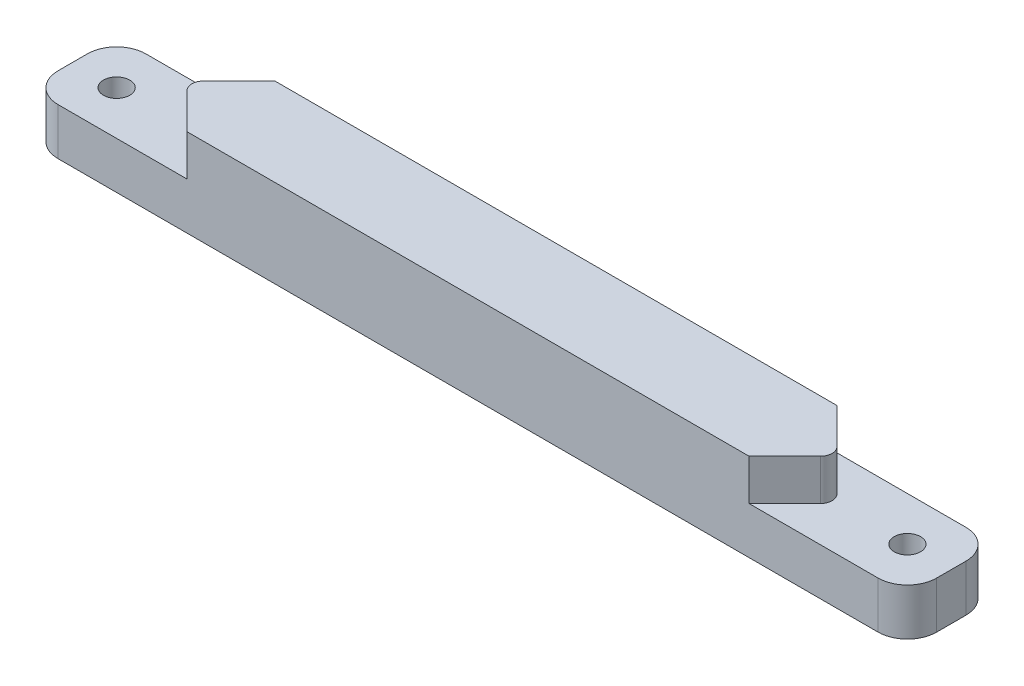
ISO-10303-21;
HEADER;
FILE_DESCRIPTION(('STEP AP214'),'2;1');
FILE_NAME('part.step','',(''),(''),'','','');
FILE_SCHEMA(('AUTOMOTIVE_DESIGN { 1 0 10303 214 1 1 1 1 }'));
ENDSEC;
DATA;
#1=APPLICATION_CONTEXT('core data for automotive mechanical design processes');
#2=APPLICATION_PROTOCOL_DEFINITION('international standard','automotive_design',2000,#1);
#3=PRODUCT_CONTEXT('',#1,'mechanical');
#4=PRODUCT('Part','Part','',(#3));
#5=PRODUCT_RELATED_PRODUCT_CATEGORY('part','',(#4));
#6=PRODUCT_DEFINITION_FORMATION('','',#4);
#7=PRODUCT_DEFINITION_CONTEXT('part definition',#1,'design');
#8=PRODUCT_DEFINITION('design','',#6,#7);
#9=PRODUCT_DEFINITION_SHAPE('','',#8);
#10=(LENGTH_UNIT() NAMED_UNIT(*) SI_UNIT(.MILLI.,.METRE.));
#11=(NAMED_UNIT(*) PLANE_ANGLE_UNIT() SI_UNIT($,.RADIAN.));
#12=(NAMED_UNIT(*) SI_UNIT($,.STERADIAN.) SOLID_ANGLE_UNIT());
#13=UNCERTAINTY_MEASURE_WITH_UNIT(LENGTH_MEASURE(1.E-05),#10,'distance_accuracy_value','');
#14=(GEOMETRIC_REPRESENTATION_CONTEXT(3) GLOBAL_UNCERTAINTY_ASSIGNED_CONTEXT((#13)) GLOBAL_UNIT_ASSIGNED_CONTEXT((#10,
#11,#12)) REPRESENTATION_CONTEXT('',''));
#15=CARTESIAN_POINT('',(0.,0.,0.));
#16=DIRECTION('',(0.,0.,1.));
#17=DIRECTION('',(1.,0.,0.));
#18=AXIS2_PLACEMENT_3D('',#15,#16,#17);
#19=CARTESIAN_POINT('',(0.,15.,0.));
#20=DIRECTION('',(0.,0.,-1.));
#21=DIRECTION('',(-1.,0.,0.));
#22=AXIS2_PLACEMENT_3D('',#19,#20,#21);
#23=PLANE('',#22);
#24=DIRECTION('',(-1.,0.,0.));
#25=VECTOR('',#24,1.);
#26=CARTESIAN_POINT('',(150.,8.,0.));
#27=LINE('',#26,#25);
#28=CARTESIAN_POINT('',(145.,8.,0.));
#29=VERTEX_POINT('',#28);
#30=CARTESIAN_POINT('',(122.979184719829,8.,0.));
#31=VERTEX_POINT('',#30);
#32=EDGE_CURVE('E172',#29,#31,#27,.T.);
#33=ORIENTED_EDGE('',*,*,#32,.T.);
#34=DIRECTION('',(0.,1.,0.));
#35=VECTOR('',#34,1.);
#36=CARTESIAN_POINT('',(122.979184719829,-10.613392206679,0.));
#37=LINE('',#36,#35);
#38=CARTESIAN_POINT('',(122.979184719829,15.,0.));
#39=VERTEX_POINT('',#38);
#40=EDGE_CURVE('E160',#31,#39,#37,.T.);
#41=ORIENTED_EDGE('',*,*,#40,.T.);
#42=DIRECTION('',(1.,0.,0.));
#43=VECTOR('',#42,1.);
#44=CARTESIAN_POINT('',(0.,15.,0.));
#45=LINE('',#44,#43);
#46=CARTESIAN_POINT('',(27.0208152801714,15.,0.));
#47=VERTEX_POINT('',#46);
#48=EDGE_CURVE('E170',#47,#39,#45,.T.);
#49=ORIENTED_EDGE('',*,*,#48,.F.);
#50=DIRECTION('',(0.,1.,0.));
#51=VECTOR('',#50,1.);
#52=CARTESIAN_POINT('',(27.0208152801714,-10.613392206679,0.));
#53=LINE('',#52,#51);
#54=CARTESIAN_POINT('',(27.0208152801714,8.,0.));
#55=VERTEX_POINT('',#54);
#56=EDGE_CURVE('E296',#55,#47,#53,.T.);
#57=ORIENTED_EDGE('',*,*,#56,.F.);
#58=DIRECTION('',(1.,0.,0.));
#59=VECTOR('',#58,1.);
#60=CARTESIAN_POINT('',(0.,8.,0.));
#61=LINE('',#60,#59);
#62=CARTESIAN_POINT('',(5.,8.,0.));
#63=VERTEX_POINT('',#62);
#64=EDGE_CURVE('E345',#63,#55,#61,.T.);
#65=ORIENTED_EDGE('',*,*,#64,.F.);
#66=DIRECTION('',(0.,-1.,0.));
#67=VECTOR('',#66,1.);
#68=CARTESIAN_POINT('',(5.,15.,0.));
#69=LINE('',#68,#67);
#70=CARTESIAN_POINT('',(5.,0.,0.));
#71=VERTEX_POINT('',#70);
#72=EDGE_CURVE('E238',#63,#71,#69,.T.);
#73=ORIENTED_EDGE('',*,*,#72,.T.);
#74=DIRECTION('',(1.,0.,0.));
#75=VECTOR('',#74,1.);
#76=CARTESIAN_POINT('',(0.,0.,0.));
#77=LINE('',#76,#75);
#78=CARTESIAN_POINT('',(145.,0.,0.));
#79=VERTEX_POINT('',#78);
#80=EDGE_CURVE('E200',#71,#79,#77,.T.);
#81=ORIENTED_EDGE('',*,*,#80,.T.);
#82=DIRECTION('',(0.,-1.,0.));
#83=VECTOR('',#82,1.);
#84=CARTESIAN_POINT('',(145.,15.,0.));
#85=LINE('',#84,#83);
#86=EDGE_CURVE('E242',#79,#29,#85,.F.);
#87=ORIENTED_EDGE('',*,*,#86,.T.);
#88=EDGE_LOOP('',(#33,#41,#49,#57,#65,#73,#81,#87));
#89=FACE_BOUND('',#88,.T.);
#90=ADVANCED_FACE('F43',(#89),#23,.F.);
#91=CARTESIAN_POINT('',(0.,15.,-15.));
#92=DIRECTION('',(0.,0.,1.));
#93=DIRECTION('',(1.,0.,0.));
#94=AXIS2_PLACEMENT_3D('',#91,#92,#93);
#95=PLANE('',#94);
#96=DIRECTION('',(-1.,0.,0.));
#97=VECTOR('',#96,1.);
#98=CARTESIAN_POINT('',(0.,15.,-15.));
#99=LINE('',#98,#97);
#100=CARTESIAN_POINT('',(122.979184719829,15.,-15.));
#101=VERTEX_POINT('',#100);
#102=CARTESIAN_POINT('',(27.0208152801714,15.,-15.));
#103=VERTEX_POINT('',#102);
#104=EDGE_CURVE('E182',#101,#103,#99,.T.);
#105=ORIENTED_EDGE('',*,*,#104,.F.);
#106=DIRECTION('',(0.,1.,0.));
#107=VECTOR('',#106,1.);
#108=CARTESIAN_POINT('',(122.979184719829,-10.613392206679,-15.));
#109=LINE('',#108,#107);
#110=CARTESIAN_POINT('',(122.979184719829,8.,-15.));
#111=VERTEX_POINT('',#110);
#112=EDGE_CURVE('E175',#111,#101,#109,.T.);
#113=ORIENTED_EDGE('',*,*,#112,.F.);
#114=DIRECTION('',(1.,0.,0.));
#115=VECTOR('',#114,1.);
#116=CARTESIAN_POINT('',(150.,8.,-15.));
#117=LINE('',#116,#115);
#118=CARTESIAN_POINT('',(145.,8.,-15.));
#119=VERTEX_POINT('',#118);
#120=EDGE_CURVE('E328',#111,#119,#117,.T.);
#121=ORIENTED_EDGE('',*,*,#120,.T.);
#122=DIRECTION('',(0.,-1.,0.));
#123=VECTOR('',#122,1.);
#124=CARTESIAN_POINT('',(145.,15.,-15.));
#125=LINE('',#124,#123);
#126=CARTESIAN_POINT('',(145.,0.,-15.));
#127=VERTEX_POINT('',#126);
#128=EDGE_CURVE('E209',#119,#127,#125,.T.);
#129=ORIENTED_EDGE('',*,*,#128,.T.);
#130=DIRECTION('',(-1.,0.,0.));
#131=VECTOR('',#130,1.);
#132=CARTESIAN_POINT('',(0.,0.,-15.));
#133=LINE('',#132,#131);
#134=CARTESIAN_POINT('',(5.,0.,-15.));
#135=VERTEX_POINT('',#134);
#136=EDGE_CURVE('E183',#127,#135,#133,.T.);
#137=ORIENTED_EDGE('',*,*,#136,.T.);
#138=DIRECTION('',(0.,-1.,0.));
#139=VECTOR('',#138,1.);
#140=CARTESIAN_POINT('',(5.,15.,-15.));
#141=LINE('',#140,#139);
#142=CARTESIAN_POINT('',(5.,8.,-15.));
#143=VERTEX_POINT('',#142);
#144=EDGE_CURVE('E187',#135,#143,#141,.F.);
#145=ORIENTED_EDGE('',*,*,#144,.T.);
#146=DIRECTION('',(-1.,0.,0.));
#147=VECTOR('',#146,1.);
#148=CARTESIAN_POINT('',(0.,8.,-15.));
#149=LINE('',#148,#147);
#150=CARTESIAN_POINT('',(27.0208152801714,7.99999999999999,-15.));
#151=VERTEX_POINT('',#150);
#152=EDGE_CURVE('E193',#151,#143,#149,.T.);
#153=ORIENTED_EDGE('',*,*,#152,.F.);
#154=DIRECTION('',(0.,1.,0.));
#155=VECTOR('',#154,1.);
#156=CARTESIAN_POINT('',(27.0208152801714,-10.613392206679,-15.));
#157=LINE('',#156,#155);
#158=EDGE_CURVE('E294',#151,#103,#157,.T.);
#159=ORIENTED_EDGE('',*,*,#158,.T.);
#160=EDGE_LOOP('',(#105,#113,#121,#129,#137,#145,#153,#159));
#161=FACE_BOUND('',#160,.T.);
#162=ADVANCED_FACE('F387',(#161),#95,.F.);
#163=CARTESIAN_POINT('',(0.,15.,0.));
#164=DIRECTION('',(0.,-1.,0.));
#165=DIRECTION('',(0.,0.,-1.));
#166=AXIS2_PLACEMENT_3D('',#163,#164,#165);
#167=PLANE('',#166);
#168=DIRECTION('',(-0.707106781186549,0.,0.707106781186546));
#169=VECTOR('',#168,1.);
#170=CARTESIAN_POINT('',(136.489592359914,15.,-13.5104076400857));
#171=LINE('',#170,#169);
#172=CARTESIAN_POINT('',(129.064971157456,15.,-6.08578643762687));
#173=VERTEX_POINT('',#172);
#174=EDGE_CURVE('E156',#173,#39,#171,.T.);
#175=ORIENTED_EDGE('',*,*,#174,.F.);
#176=CARTESIAN_POINT('',(127.650757595082,15.,-7.49999999999997));
#177=DIRECTION('',(0.,-1.,0.));
#178=DIRECTION('',(0.,0.,-1.));
#179=AXIS2_PLACEMENT_3D('',#176,#177,#178);
#180=CIRCLE('',#179,2.);
#181=CARTESIAN_POINT('',(129.064971157456,15.,-8.91421356237305));
#182=VERTEX_POINT('',#181);
#183=EDGE_CURVE('E66',#173,#182,#180,.F.);
#184=ORIENTED_EDGE('',*,*,#183,.T.);
#185=DIRECTION('',(0.707106781186546,0.,0.707106781186549));
#186=VECTOR('',#185,1.);
#187=CARTESIAN_POINT('',(143.989592359914,15.,6.01040764008574));
#188=LINE('',#187,#186);
#189=EDGE_CURVE('E165',#101,#182,#188,.T.);
#190=ORIENTED_EDGE('',*,*,#189,.F.);
#191=ORIENTED_EDGE('',*,*,#104,.T.);
#192=DIRECTION('',(-0.707106781186546,0.,0.707106781186549));
#193=VECTOR('',#192,1.);
#194=CARTESIAN_POINT('',(6.01040764008576,15.,6.01040764008574));
#195=LINE('',#194,#193);
#196=CARTESIAN_POINT('',(20.9350288425445,15.,-8.91421356237306));
#197=VERTEX_POINT('',#196);
#198=EDGE_CURVE('E299',#103,#197,#195,.T.);
#199=ORIENTED_EDGE('',*,*,#198,.T.);
#200=CARTESIAN_POINT('',(22.3492424049176,15.,-7.49999999999996));
#201=DIRECTION('',(0.,-1.,0.));
#202=DIRECTION('',(0.,0.,-1.));
#203=AXIS2_PLACEMENT_3D('',#200,#201,#202);
#204=CIRCLE('',#203,2.);
#205=CARTESIAN_POINT('',(20.9350288425445,15.,-6.08578643762686));
#206=VERTEX_POINT('',#205);
#207=EDGE_CURVE('E262',#197,#206,#204,.F.);
#208=ORIENTED_EDGE('',*,*,#207,.T.);
#209=DIRECTION('',(0.707106781186549,0.,0.707106781186546));
#210=VECTOR('',#209,1.);
#211=CARTESIAN_POINT('',(13.5104076400856,15.,-13.5104076400857));
#212=LINE('',#211,#210);
#213=EDGE_CURVE('E179',#206,#47,#212,.T.);
#214=ORIENTED_EDGE('',*,*,#213,.T.);
#215=ORIENTED_EDGE('',*,*,#48,.T.);
#216=EDGE_LOOP('',(#175,#184,#190,#191,#199,#208,#214,#215));
#217=FACE_BOUND('',#216,.T.);
#218=ADVANCED_FACE('F177',(#217),#167,.F.);
#219=CARTESIAN_POINT('',(150.,15.,0.));
#220=DIRECTION('',(-1.,0.,0.));
#221=DIRECTION('',(0.,0.,1.));
#222=AXIS2_PLACEMENT_3D('',#219,#220,#221);
#223=PLANE('',#222);
#224=DIRECTION('',(0.,0.,-1.));
#225=VECTOR('',#224,1.);
#226=CARTESIAN_POINT('',(150.,0.,0.));
#227=LINE('',#226,#225);
#228=CARTESIAN_POINT('',(150.,0.,-5.));
#229=VERTEX_POINT('',#228);
#230=CARTESIAN_POINT('',(150.,0.,-10.));
#231=VERTEX_POINT('',#230);
#232=EDGE_CURVE('E190',#229,#231,#227,.T.);
#233=ORIENTED_EDGE('',*,*,#232,.T.);
#234=DIRECTION('',(0.,-1.,0.));
#235=VECTOR('',#234,1.);
#236=CARTESIAN_POINT('',(150.,15.,-10.));
#237=LINE('',#236,#235);
#238=CARTESIAN_POINT('',(150.,8.,-10.));
#239=VERTEX_POINT('',#238);
#240=EDGE_CURVE('E229',#231,#239,#237,.F.);
#241=ORIENTED_EDGE('',*,*,#240,.T.);
#242=DIRECTION('',(0.,0.,1.));
#243=VECTOR('',#242,1.);
#244=CARTESIAN_POINT('',(150.,8.,-15.));
#245=LINE('',#244,#243);
#246=CARTESIAN_POINT('',(150.,8.,-5.));
#247=VERTEX_POINT('',#246);
#248=EDGE_CURVE('E324',#239,#247,#245,.T.);
#249=ORIENTED_EDGE('',*,*,#248,.T.);
#250=DIRECTION('',(0.,-1.,0.));
#251=VECTOR('',#250,1.);
#252=CARTESIAN_POINT('',(150.,15.,-5.));
#253=LINE('',#252,#251);
#254=EDGE_CURVE('E225',#247,#229,#253,.T.);
#255=ORIENTED_EDGE('',*,*,#254,.T.);
#256=EDGE_LOOP('',(#233,#241,#249,#255));
#257=FACE_BOUND('',#256,.T.);
#258=ADVANCED_FACE('F378',(#257),#223,.F.);
#259=CARTESIAN_POINT('',(0.,15.,0.));
#260=DIRECTION('',(1.,0.,0.));
#261=DIRECTION('',(0.,0.,-1.));
#262=AXIS2_PLACEMENT_3D('',#259,#260,#261);
#263=PLANE('',#262);
#264=DIRECTION('',(0.,0.,1.));
#265=VECTOR('',#264,1.);
#266=CARTESIAN_POINT('',(0.,8.,-15.));
#267=LINE('',#266,#265);
#268=CARTESIAN_POINT('',(0.,8.,-10.));
#269=VERTEX_POINT('',#268);
#270=CARTESIAN_POINT('',(0.,8.,-5.));
#271=VERTEX_POINT('',#270);
#272=EDGE_CURVE('E342',#269,#271,#267,.T.);
#273=ORIENTED_EDGE('',*,*,#272,.F.);
#274=DIRECTION('',(0.,-1.,0.));
#275=VECTOR('',#274,1.);
#276=CARTESIAN_POINT('',(0.,15.,-10.));
#277=LINE('',#276,#275);
#278=CARTESIAN_POINT('',(0.,0.,-10.));
#279=VERTEX_POINT('',#278);
#280=EDGE_CURVE('E248',#269,#279,#277,.T.);
#281=ORIENTED_EDGE('',*,*,#280,.T.);
#282=DIRECTION('',(0.,0.,1.));
#283=VECTOR('',#282,1.);
#284=CARTESIAN_POINT('',(0.,0.,0.));
#285=LINE('',#284,#283);
#286=CARTESIAN_POINT('',(0.,0.,-5.));
#287=VERTEX_POINT('',#286);
#288=EDGE_CURVE('E196',#279,#287,#285,.T.);
#289=ORIENTED_EDGE('',*,*,#288,.T.);
#290=DIRECTION('',(0.,-1.,0.));
#291=VECTOR('',#290,1.);
#292=CARTESIAN_POINT('',(0.,15.,-5.));
#293=LINE('',#292,#291);
#294=EDGE_CURVE('E245',#287,#271,#293,.F.);
#295=ORIENTED_EDGE('',*,*,#294,.T.);
#296=EDGE_LOOP('',(#273,#281,#289,#295));
#297=FACE_BOUND('',#296,.T.);
#298=ADVANCED_FACE('F358',(#297),#263,.F.);
#299=CARTESIAN_POINT('',(0.,0.,0.));
#300=DIRECTION('',(0.,-1.,0.));
#301=DIRECTION('',(0.,0.,-1.));
#302=AXIS2_PLACEMENT_3D('',#299,#300,#301);
#303=PLANE('',#302);
#304=CARTESIAN_POINT('',(142.5,0.,-7.5));
#305=DIRECTION('',(0.,-1.,0.));
#306=DIRECTION('',(0.,0.,-1.));
#307=AXIS2_PLACEMENT_3D('',#304,#305,#306);
#308=CIRCLE('',#307,2.25);
#309=CARTESIAN_POINT('',(142.5,0.,-9.75));
#310=VERTEX_POINT('',#309);
#311=EDGE_CURVE('E320',#310,#310,#308,.T.);
#312=ORIENTED_EDGE('',*,*,#311,.F.);
#313=EDGE_LOOP('',(#312));
#314=FACE_BOUND('',#313,.T.);
#315=CARTESIAN_POINT('',(7.5,0.,-7.5));
#316=DIRECTION('',(0.,-1.,0.));
#317=DIRECTION('',(0.,0.,-1.));
#318=AXIS2_PLACEMENT_3D('',#315,#316,#317);
#319=CIRCLE('',#318,2.25);
#320=CARTESIAN_POINT('',(7.5,0.,-9.75));
#321=VERTEX_POINT('',#320);
#322=EDGE_CURVE('E338',#321,#321,#319,.F.);
#323=ORIENTED_EDGE('',*,*,#322,.T.);
#324=EDGE_LOOP('',(#323));
#325=FACE_BOUND('',#324,.T.);
#326=ORIENTED_EDGE('',*,*,#136,.F.);
#327=CARTESIAN_POINT('',(145.,0.,-10.));
#328=DIRECTION('',(0.,-1.,0.));
#329=DIRECTION('',(0.,0.,-1.));
#330=AXIS2_PLACEMENT_3D('',#327,#328,#329);
#331=CIRCLE('',#330,5.);
#332=EDGE_CURVE('E222',#127,#231,#331,.T.);
#333=ORIENTED_EDGE('',*,*,#332,.T.);
#334=ORIENTED_EDGE('',*,*,#232,.F.);
#335=CARTESIAN_POINT('',(145.,0.,-5.));
#336=DIRECTION('',(0.,-1.,0.));
#337=DIRECTION('',(0.,0.,-1.));
#338=AXIS2_PLACEMENT_3D('',#335,#336,#337);
#339=CIRCLE('',#338,5.);
#340=EDGE_CURVE('E219',#229,#79,#339,.T.);
#341=ORIENTED_EDGE('',*,*,#340,.T.);
#342=ORIENTED_EDGE('',*,*,#80,.F.);
#343=CARTESIAN_POINT('',(5.,0.,-5.));
#344=DIRECTION('',(0.,-1.,0.));
#345=DIRECTION('',(0.,0.,-1.));
#346=AXIS2_PLACEMENT_3D('',#343,#344,#345);
#347=CIRCLE('',#346,5.);
#348=EDGE_CURVE('E213',#71,#287,#347,.T.);
#349=ORIENTED_EDGE('',*,*,#348,.T.);
#350=ORIENTED_EDGE('',*,*,#288,.F.);
#351=CARTESIAN_POINT('',(5.,0.,-10.));
#352=DIRECTION('',(0.,-1.,0.));
#353=DIRECTION('',(0.,0.,-1.));
#354=AXIS2_PLACEMENT_3D('',#351,#352,#353);
#355=CIRCLE('',#354,5.);
#356=EDGE_CURVE('E216',#279,#135,#355,.T.);
#357=ORIENTED_EDGE('',*,*,#356,.T.);
#358=EDGE_LOOP('',(#326,#333,#334,#341,#342,#349,#350,#357));
#359=FACE_BOUND('',#358,.T.);
#360=ADVANCED_FACE('F362',(#314,#325,#359),#303,.T.);
#361=CARTESIAN_POINT('',(0.,8.,0.));
#362=DIRECTION('',(0.,1.,0.));
#363=DIRECTION('',(0.,0.,1.));
#364=AXIS2_PLACEMENT_3D('',#361,#362,#363);
#365=PLANE('',#364);
#366=CARTESIAN_POINT('',(7.5,8.,-7.5));
#367=DIRECTION('',(0.,1.,0.));
#368=DIRECTION('',(0.,0.,1.));
#369=AXIS2_PLACEMENT_3D('',#366,#367,#368);
#370=CIRCLE('',#369,2.25);
#371=CARTESIAN_POINT('',(7.5,8.,-5.25));
#372=VERTEX_POINT('',#371);
#373=EDGE_CURVE('E334',#372,#372,#370,.T.);
#374=ORIENTED_EDGE('',*,*,#373,.F.);
#375=EDGE_LOOP('',(#374));
#376=FACE_BOUND('',#375,.T.);
#377=ORIENTED_EDGE('',*,*,#152,.T.);
#378=CARTESIAN_POINT('',(5.,8.,-10.));
#379=DIRECTION('',(0.,1.,0.));
#380=DIRECTION('',(0.,0.,1.));
#381=AXIS2_PLACEMENT_3D('',#378,#379,#380);
#382=CIRCLE('',#381,5.);
#383=EDGE_CURVE('E255',#143,#269,#382,.T.);
#384=ORIENTED_EDGE('',*,*,#383,.T.);
#385=ORIENTED_EDGE('',*,*,#272,.T.);
#386=CARTESIAN_POINT('',(5.,8.,-5.));
#387=DIRECTION('',(0.,1.,0.));
#388=DIRECTION('',(0.,0.,1.));
#389=AXIS2_PLACEMENT_3D('',#386,#387,#388);
#390=CIRCLE('',#389,5.);
#391=EDGE_CURVE('E252',#271,#63,#390,.T.);
#392=ORIENTED_EDGE('',*,*,#391,.T.);
#393=ORIENTED_EDGE('',*,*,#64,.T.);
#394=DIRECTION('',(-0.707106781186549,0.,-0.707106781186546));
#395=VECTOR('',#394,1.);
#396=CARTESIAN_POINT('',(13.5104076400856,8.,-13.5104076400857));
#397=LINE('',#396,#395);
#398=CARTESIAN_POINT('',(20.9350288425445,8.,-6.08578643762687));
#399=VERTEX_POINT('',#398);
#400=EDGE_CURVE('E284',#55,#399,#397,.T.);
#401=ORIENTED_EDGE('',*,*,#400,.T.);
#402=CARTESIAN_POINT('',(22.3492424049176,8.,-7.49999999999996));
#403=DIRECTION('',(0.,1.,0.));
#404=DIRECTION('',(0.,0.,1.));
#405=AXIS2_PLACEMENT_3D('',#402,#403,#404);
#406=CIRCLE('',#405,2.);
#407=CARTESIAN_POINT('',(20.9350288425445,8.,-8.91421356237305));
#408=VERTEX_POINT('',#407);
#409=EDGE_CURVE('E268',#399,#408,#406,.F.);
#410=ORIENTED_EDGE('',*,*,#409,.T.);
#411=DIRECTION('',(0.707106781186546,0.,-0.707106781186549));
#412=VECTOR('',#411,1.);
#413=CARTESIAN_POINT('',(6.01040764008576,8.,6.01040764008574));
#414=LINE('',#413,#412);
#415=EDGE_CURVE('E281',#408,#151,#414,.T.);
#416=ORIENTED_EDGE('',*,*,#415,.T.);
#417=EDGE_LOOP('',(#377,#384,#385,#392,#393,#401,#410,#416));
#418=FACE_BOUND('',#417,.T.);
#419=ADVANCED_FACE('F280',(#376,#418),#365,.T.);
#420=CARTESIAN_POINT('',(7.5,-6.36396103067893,-7.5));
#421=DIRECTION('',(0.,1.,0.));
#422=DIRECTION('',(0.,0.,1.));
#423=AXIS2_PLACEMENT_3D('',#420,#421,#422);
#424=CYLINDRICAL_SURFACE('',#423,2.25);
#425=ORIENTED_EDGE('',*,*,#373,.T.);
#426=EDGE_LOOP('',(#425));
#427=FACE_BOUND('',#426,.T.);
#428=ORIENTED_EDGE('',*,*,#322,.F.);
#429=EDGE_LOOP('',(#428));
#430=FACE_BOUND('',#429,.T.);
#431=ADVANCED_FACE('F437',(#427,#430),#424,.F.);
#432=CARTESIAN_POINT('',(150.,8.,0.));
#433=DIRECTION('',(0.,1.,0.));
#434=DIRECTION('',(0.,0.,1.));
#435=AXIS2_PLACEMENT_3D('',#432,#433,#434);
#436=PLANE('',#435);
#437=CARTESIAN_POINT('',(142.5,8.,-7.5));
#438=DIRECTION('',(0.,-1.,0.));
#439=DIRECTION('',(0.,0.,1.));
#440=AXIS2_PLACEMENT_3D('',#437,#438,#439);
#441=CIRCLE('',#440,2.25);
#442=CARTESIAN_POINT('',(142.5,8.,-5.25));
#443=VERTEX_POINT('',#442);
#444=EDGE_CURVE('E316',#443,#443,#441,.T.);
#445=ORIENTED_EDGE('',*,*,#444,.T.);
#446=EDGE_LOOP('',(#445));
#447=FACE_BOUND('',#446,.T.);
#448=ORIENTED_EDGE('',*,*,#248,.F.);
#449=CARTESIAN_POINT('',(145.,8.,-10.));
#450=DIRECTION('',(0.,1.,0.));
#451=DIRECTION('',(0.,0.,1.));
#452=AXIS2_PLACEMENT_3D('',#449,#450,#451);
#453=CIRCLE('',#452,5.);
#454=EDGE_CURVE('E235',#239,#119,#453,.T.);
#455=ORIENTED_EDGE('',*,*,#454,.T.);
#456=ORIENTED_EDGE('',*,*,#120,.F.);
#457=DIRECTION('',(-0.707106781186546,0.,-0.707106781186549));
#458=VECTOR('',#457,1.);
#459=CARTESIAN_POINT('',(143.989592359914,8.,6.01040764008574));
#460=LINE('',#459,#458);
#461=CARTESIAN_POINT('',(129.064971157456,8.,-8.91421356237305));
#462=VERTEX_POINT('',#461);
#463=EDGE_CURVE('E308',#462,#111,#460,.T.);
#464=ORIENTED_EDGE('',*,*,#463,.F.);
#465=CARTESIAN_POINT('',(127.650757595082,8.,-7.49999999999997));
#466=DIRECTION('',(0.,1.,0.));
#467=DIRECTION('',(0.,0.,1.));
#468=AXIS2_PLACEMENT_3D('',#465,#466,#467);
#469=CIRCLE('',#468,2.);
#470=CARTESIAN_POINT('',(129.064971157456,8.,-6.08578643762687));
#471=VERTEX_POINT('',#470);
#472=EDGE_CURVE('E12',#462,#471,#469,.F.);
#473=ORIENTED_EDGE('',*,*,#472,.T.);
#474=DIRECTION('',(0.707106781186549,0.,-0.707106781186546));
#475=VECTOR('',#474,1.);
#476=CARTESIAN_POINT('',(136.489592359914,8.,-13.5104076400857));
#477=LINE('',#476,#475);
#478=EDGE_CURVE('E303',#31,#471,#477,.T.);
#479=ORIENTED_EDGE('',*,*,#478,.F.);
#480=ORIENTED_EDGE('',*,*,#32,.F.);
#481=CARTESIAN_POINT('',(145.,8.,-5.));
#482=DIRECTION('',(0.,1.,0.));
#483=DIRECTION('',(0.,0.,1.));
#484=AXIS2_PLACEMENT_3D('',#481,#482,#483);
#485=CIRCLE('',#484,5.);
#486=EDGE_CURVE('E232',#29,#247,#485,.T.);
#487=ORIENTED_EDGE('',*,*,#486,.T.);
#488=EDGE_LOOP('',(#448,#455,#456,#464,#473,#479,#480,#487));
#489=FACE_BOUND('',#488,.T.);
#490=ADVANCED_FACE('F375',(#447,#489),#436,.T.);
#491=CARTESIAN_POINT('',(142.5,-6.36396103067893,-7.5));
#492=DIRECTION('',(0.,1.,0.));
#493=DIRECTION('',(0.,0.,1.));
#494=AXIS2_PLACEMENT_3D('',#491,#492,#493);
#495=CYLINDRICAL_SURFACE('',#494,2.25);
#496=ORIENTED_EDGE('',*,*,#444,.F.);
#497=EDGE_LOOP('',(#496));
#498=FACE_BOUND('',#497,.T.);
#499=ORIENTED_EDGE('',*,*,#311,.T.);
#500=EDGE_LOOP('',(#499));
#501=FACE_BOUND('',#500,.T.);
#502=ADVANCED_FACE('F414',(#498,#501),#495,.F.);
#503=CARTESIAN_POINT('',(145.,15.,-10.));
#504=DIRECTION('',(0.,-1.,0.));
#505=DIRECTION('',(0.,0.,-1.));
#506=AXIS2_PLACEMENT_3D('',#503,#504,#505);
#507=CYLINDRICAL_SURFACE('',#506,5.);
#508=ORIENTED_EDGE('',*,*,#454,.F.);
#509=ORIENTED_EDGE('',*,*,#240,.F.);
#510=ORIENTED_EDGE('',*,*,#332,.F.);
#511=ORIENTED_EDGE('',*,*,#128,.F.);
#512=EDGE_LOOP('',(#508,#509,#510,#511));
#513=FACE_BOUND('',#512,.T.);
#514=ADVANCED_FACE('F382',(#513),#507,.T.);
#515=CARTESIAN_POINT('',(145.,15.,-5.));
#516=DIRECTION('',(0.,-1.,0.));
#517=DIRECTION('',(0.,0.,-1.));
#518=AXIS2_PLACEMENT_3D('',#515,#516,#517);
#519=CYLINDRICAL_SURFACE('',#518,5.);
#520=ORIENTED_EDGE('',*,*,#486,.F.);
#521=ORIENTED_EDGE('',*,*,#86,.F.);
#522=ORIENTED_EDGE('',*,*,#340,.F.);
#523=ORIENTED_EDGE('',*,*,#254,.F.);
#524=EDGE_LOOP('',(#520,#521,#522,#523));
#525=FACE_BOUND('',#524,.T.);
#526=ADVANCED_FACE('F371',(#525),#519,.T.);
#527=CARTESIAN_POINT('',(5.,15.,-10.));
#528=DIRECTION('',(0.,-1.,0.));
#529=DIRECTION('',(0.,0.,-1.));
#530=AXIS2_PLACEMENT_3D('',#527,#528,#529);
#531=CYLINDRICAL_SURFACE('',#530,5.);
#532=ORIENTED_EDGE('',*,*,#383,.F.);
#533=ORIENTED_EDGE('',*,*,#144,.F.);
#534=ORIENTED_EDGE('',*,*,#356,.F.);
#535=ORIENTED_EDGE('',*,*,#280,.F.);
#536=EDGE_LOOP('',(#532,#533,#534,#535));
#537=FACE_BOUND('',#536,.T.);
#538=ADVANCED_FACE('F355',(#537),#531,.T.);
#539=CARTESIAN_POINT('',(5.,15.,-5.));
#540=DIRECTION('',(0.,-1.,0.));
#541=DIRECTION('',(0.,0.,-1.));
#542=AXIS2_PLACEMENT_3D('',#539,#540,#541);
#543=CYLINDRICAL_SURFACE('',#542,5.);
#544=ORIENTED_EDGE('',*,*,#391,.F.);
#545=ORIENTED_EDGE('',*,*,#294,.F.);
#546=ORIENTED_EDGE('',*,*,#348,.F.);
#547=ORIENTED_EDGE('',*,*,#72,.F.);
#548=EDGE_LOOP('',(#544,#545,#546,#547));
#549=FACE_BOUND('',#548,.T.);
#550=ADVANCED_FACE('F367',(#549),#543,.T.);
#551=CARTESIAN_POINT('',(6.01040764008576,-10.613392206679,6.01040764008574));
#552=DIRECTION('',(-0.707106781186549,0.,-0.707106781186546));
#553=DIRECTION('',(-0.707106781186546,0.,0.707106781186549));
#554=AXIS2_PLACEMENT_3D('',#551,#552,#553);
#555=PLANE('',#554);
#556=ORIENTED_EDGE('',*,*,#415,.F.);
#557=DIRECTION('',(0.,1.,0.));
#558=VECTOR('',#557,1.);
#559=CARTESIAN_POINT('',(20.9350288425445,-10.613392206679,-8.91421356237305));
#560=LINE('',#559,#558);
#561=EDGE_CURVE('E258',#408,#197,#560,.T.);
#562=ORIENTED_EDGE('',*,*,#561,.T.);
#563=ORIENTED_EDGE('',*,*,#198,.F.);
#564=ORIENTED_EDGE('',*,*,#158,.F.);
#565=EDGE_LOOP('',(#556,#562,#563,#564));
#566=FACE_BOUND('',#565,.T.);
#567=ADVANCED_FACE('F290',(#566),#555,.T.);
#568=CARTESIAN_POINT('',(13.5104076400856,-10.613392206679,-13.5104076400857));
#569=DIRECTION('',(-0.707106781186546,0.,0.707106781186549));
#570=DIRECTION('',(0.707106781186549,0.,0.707106781186546));
#571=AXIS2_PLACEMENT_3D('',#568,#569,#570);
#572=PLANE('',#571);
#573=ORIENTED_EDGE('',*,*,#213,.F.);
#574=DIRECTION('',(0.,1.,0.));
#575=VECTOR('',#574,1.);
#576=CARTESIAN_POINT('',(20.9350288425445,-10.613392206679,-6.08578643762687));
#577=LINE('',#576,#575);
#578=EDGE_CURVE('E265',#206,#399,#577,.F.);
#579=ORIENTED_EDGE('',*,*,#578,.T.);
#580=ORIENTED_EDGE('',*,*,#400,.F.);
#581=ORIENTED_EDGE('',*,*,#56,.T.);
#582=EDGE_LOOP('',(#573,#579,#580,#581));
#583=FACE_BOUND('',#582,.T.);
#584=ADVANCED_FACE('F301',(#583),#572,.T.);
#585=CARTESIAN_POINT('',(22.3492424049176,-10.613392206679,-7.49999999999996));
#586=DIRECTION('',(0.,1.,0.));
#587=DIRECTION('',(0.,0.,1.));
#588=AXIS2_PLACEMENT_3D('',#585,#586,#587);
#589=CYLINDRICAL_SURFACE('',#588,2.);
#590=ORIENTED_EDGE('',*,*,#409,.F.);
#591=ORIENTED_EDGE('',*,*,#578,.F.);
#592=ORIENTED_EDGE('',*,*,#207,.F.);
#593=ORIENTED_EDGE('',*,*,#561,.F.);
#594=EDGE_LOOP('',(#590,#591,#592,#593));
#595=FACE_BOUND('',#594,.T.);
#596=ADVANCED_FACE('F298',(#595),#589,.T.);
#597=CARTESIAN_POINT('',(143.989592359914,-10.613392206679,6.01040764008574));
#598=DIRECTION('',(-0.707106781186549,0.,0.707106781186546));
#599=DIRECTION('',(0.707106781186546,0.,0.707106781186549));
#600=AXIS2_PLACEMENT_3D('',#597,#598,#599);
#601=PLANE('',#600);
#602=ORIENTED_EDGE('',*,*,#189,.T.);
#603=DIRECTION('',(0.,1.,0.));
#604=VECTOR('',#603,1.);
#605=CARTESIAN_POINT('',(129.064971157456,-10.613392206679,-8.91421356237305));
#606=LINE('',#605,#604);
#607=EDGE_CURVE('E52',#182,#462,#606,.F.);
#608=ORIENTED_EDGE('',*,*,#607,.T.);
#609=ORIENTED_EDGE('',*,*,#463,.T.);
#610=ORIENTED_EDGE('',*,*,#112,.T.);
#611=EDGE_LOOP('',(#602,#608,#609,#610));
#612=FACE_BOUND('',#611,.T.);
#613=ADVANCED_FACE('F394',(#612),#601,.F.);
#614=CARTESIAN_POINT('',(136.489592359914,-10.613392206679,-13.5104076400857));
#615=DIRECTION('',(-0.707106781186546,0.,-0.707106781186549));
#616=DIRECTION('',(-0.707106781186549,0.,0.707106781186546));
#617=AXIS2_PLACEMENT_3D('',#614,#615,#616);
#618=PLANE('',#617);
#619=ORIENTED_EDGE('',*,*,#478,.T.);
#620=DIRECTION('',(0.,1.,0.));
#621=VECTOR('',#620,1.);
#622=CARTESIAN_POINT('',(129.064971157456,-10.613392206679,-6.08578643762687));
#623=LINE('',#622,#621);
#624=EDGE_CURVE('E162',#471,#173,#623,.T.);
#625=ORIENTED_EDGE('',*,*,#624,.T.);
#626=ORIENTED_EDGE('',*,*,#174,.T.);
#627=ORIENTED_EDGE('',*,*,#40,.F.);
#628=EDGE_LOOP('',(#619,#625,#626,#627));
#629=FACE_BOUND('',#628,.T.);
#630=ADVANCED_FACE('F159',(#629),#618,.F.);
#631=CARTESIAN_POINT('',(127.650757595082,-10.613392206679,-7.49999999999997));
#632=DIRECTION('',(0.,1.,0.));
#633=DIRECTION('',(0.,0.,1.));
#634=AXIS2_PLACEMENT_3D('',#631,#632,#633);
#635=CYLINDRICAL_SURFACE('',#634,2.);
#636=ORIENTED_EDGE('',*,*,#472,.F.);
#637=ORIENTED_EDGE('',*,*,#607,.F.);
#638=ORIENTED_EDGE('',*,*,#183,.F.);
#639=ORIENTED_EDGE('',*,*,#624,.F.);
#640=EDGE_LOOP('',(#636,#637,#638,#639));
#641=FACE_BOUND('',#640,.T.);
#642=ADVANCED_FACE('F45',(#641),#635,.T.);
#643=CLOSED_SHELL('',(#90,#162,#218,#258,#298,#360,#419,#431,#490,#502,#514,#526,#538,#550,#567,
#584,#596,#613,#630,#642));
#644=MANIFOLD_SOLID_BREP('B2',#643);
#645=ADVANCED_BREP_SHAPE_REPRESENTATION('',(#18,#644),#14);
#646=SHAPE_DEFINITION_REPRESENTATION(#9,#645);
ENDSEC;
END-ISO-10303-21;
